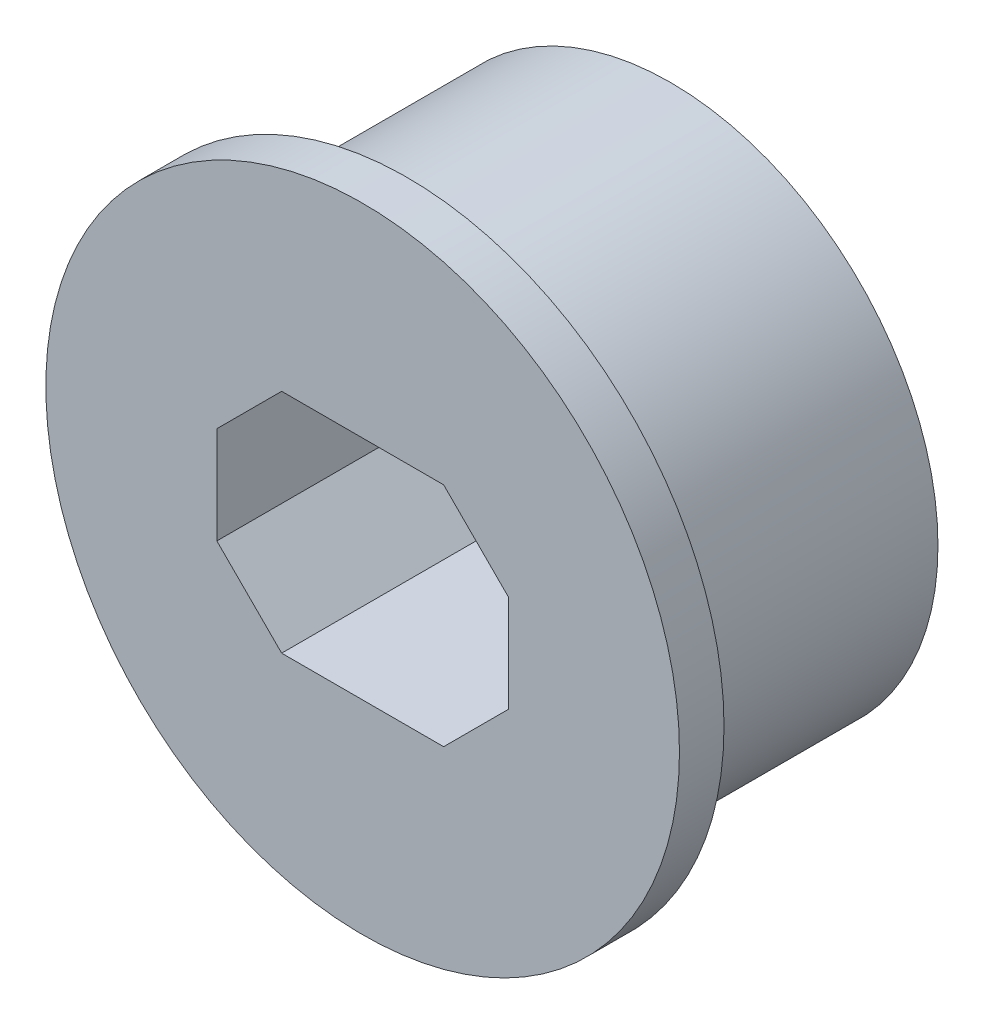
ISO-10303-21;
HEADER;
FILE_DESCRIPTION(('STEP AP214'),'2;1');
FILE_NAME('part.step','',(''),(''),'','','');
FILE_SCHEMA(('AUTOMOTIVE_DESIGN { 1 0 10303 214 1 1 1 1 }'));
ENDSEC;
DATA;
#1=APPLICATION_CONTEXT('core data for automotive mechanical design processes');
#2=APPLICATION_PROTOCOL_DEFINITION('international standard','automotive_design',2000,#1);
#3=PRODUCT_CONTEXT('',#1,'mechanical');
#4=PRODUCT('Part','Part','',(#3));
#5=PRODUCT_RELATED_PRODUCT_CATEGORY('part','',(#4));
#6=PRODUCT_DEFINITION_FORMATION('','',#4);
#7=PRODUCT_DEFINITION_CONTEXT('part definition',#1,'design');
#8=PRODUCT_DEFINITION('design','',#6,#7);
#9=PRODUCT_DEFINITION_SHAPE('','',#8);
#10=(LENGTH_UNIT() NAMED_UNIT(*) SI_UNIT(.MILLI.,.METRE.));
#11=(NAMED_UNIT(*) PLANE_ANGLE_UNIT() SI_UNIT($,.RADIAN.));
#12=(NAMED_UNIT(*) SI_UNIT($,.STERADIAN.) SOLID_ANGLE_UNIT());
#13=UNCERTAINTY_MEASURE_WITH_UNIT(LENGTH_MEASURE(1.E-05),#10,'distance_accuracy_value','');
#14=(GEOMETRIC_REPRESENTATION_CONTEXT(3) GLOBAL_UNCERTAINTY_ASSIGNED_CONTEXT((#13)) GLOBAL_UNIT_ASSIGNED_CONTEXT((#10,
#11,#12)) REPRESENTATION_CONTEXT('',''));
#15=CARTESIAN_POINT('',(0.,0.,0.));
#16=DIRECTION('',(0.,0.,1.));
#17=DIRECTION('',(1.,0.,0.));
#18=AXIS2_PLACEMENT_3D('',#15,#16,#17);
#19=CARTESIAN_POINT('',(6.731,-165.719229699861,1.5875));
#20=DIRECTION('',(0.,0.,-1.));
#21=DIRECTION('',(-1.,0.,0.));
#22=AXIS2_PLACEMENT_3D('',#19,#20,#21);
#23=CYLINDRICAL_SURFACE('',#22,4.8895);
#24=CARTESIAN_POINT('',(6.731,-165.719229699861,0.));
#25=DIRECTION('',(0.,0.,1.));
#26=DIRECTION('',(1.,0.,0.));
#27=AXIS2_PLACEMENT_3D('',#24,#25,#26);
#28=CIRCLE('',#27,4.8895);
#29=CARTESIAN_POINT('',(11.6205,-165.719229699861,0.));
#30=VERTEX_POINT('',#29);
#31=EDGE_CURVE('E150',#30,#30,#28,.T.);
#32=ORIENTED_EDGE('',*,*,#31,.T.);
#33=EDGE_LOOP('',(#32));
#34=FACE_BOUND('',#33,.T.);
#35=CARTESIAN_POINT('',(6.731,-165.719229699861,0.6875));
#36=DIRECTION('',(0.,0.,1.));
#37=DIRECTION('',(1.,0.,0.));
#38=AXIS2_PLACEMENT_3D('',#35,#36,#37);
#39=CIRCLE('',#38,4.8895);
#40=CARTESIAN_POINT('',(11.6205,-165.719229699861,0.6875));
#41=VERTEX_POINT('',#40);
#42=EDGE_CURVE('E112',#41,#41,#39,.T.);
#43=ORIENTED_EDGE('',*,*,#42,.F.);
#44=EDGE_LOOP('',(#43));
#45=FACE_BOUND('',#44,.T.);
#46=ADVANCED_FACE('F35',(#34,#45),#23,.T.);
#47=CARTESIAN_POINT('',(4.48100000000001,-163.969229699861,1.5875));
#48=DIRECTION('',(-1.,0.,0.));
#49=DIRECTION('',(0.,0.,1.));
#50=AXIS2_PLACEMENT_3D('',#47,#48,#49);
#51=PLANE('',#50);
#52=DIRECTION('',(0.,1.,0.));
#53=VECTOR('',#52,1.);
#54=CARTESIAN_POINT('',(4.48100000000001,-163.969229699861,0.6875));
#55=LINE('',#54,#53);
#56=CARTESIAN_POINT('',(4.48100000000001,-166.469229699861,0.6875));
#57=VERTEX_POINT('',#56);
#58=CARTESIAN_POINT('',(4.48100000000001,-164.969229699861,0.6875));
#59=VERTEX_POINT('',#58);
#60=EDGE_CURVE('E49',#57,#59,#55,.T.);
#61=ORIENTED_EDGE('',*,*,#60,.F.);
#62=DIRECTION('',(0.,0.,-1.));
#63=VECTOR('',#62,1.);
#64=CARTESIAN_POINT('',(4.48100000000001,-166.469229699861,-4.064));
#65=LINE('',#64,#63);
#66=CARTESIAN_POINT('',(4.48100000000001,-166.469229699861,-4.064));
#67=VERTEX_POINT('',#66);
#68=EDGE_CURVE('E128',#57,#67,#65,.T.);
#69=ORIENTED_EDGE('',*,*,#68,.T.);
#70=DIRECTION('',(0.,1.,0.));
#71=VECTOR('',#70,1.);
#72=CARTESIAN_POINT('',(4.48100000000001,-163.969229699861,-4.064));
#73=LINE('',#72,#71);
#74=CARTESIAN_POINT('',(4.48100000000001,-164.969229699861,-4.064));
#75=VERTEX_POINT('',#74);
#76=EDGE_CURVE('E141',#67,#75,#73,.T.);
#77=ORIENTED_EDGE('',*,*,#76,.T.);
#78=DIRECTION('',(0.,0.,1.));
#79=VECTOR('',#78,1.);
#80=CARTESIAN_POINT('',(4.48100000000001,-164.969229699861,1.5875));
#81=LINE('',#80,#79);
#82=EDGE_CURVE('E126',#75,#59,#81,.T.);
#83=ORIENTED_EDGE('',*,*,#82,.T.);
#84=EDGE_LOOP('',(#61,#69,#77,#83));
#85=FACE_BOUND('',#84,.T.);
#86=ADVANCED_FACE('F202',(#85),#51,.F.);
#87=CARTESIAN_POINT('',(8.98100000000001,-167.469229699861,1.5875));
#88=DIRECTION('',(0.,-1.,0.));
#89=DIRECTION('',(0.,0.,-1.));
#90=AXIS2_PLACEMENT_3D('',#87,#88,#89);
#91=PLANE('',#90);
#92=DIRECTION('',(-1.,0.,0.));
#93=VECTOR('',#92,1.);
#94=CARTESIAN_POINT('',(8.98100000000001,-167.469229699861,0.6875));
#95=LINE('',#94,#93);
#96=CARTESIAN_POINT('',(7.98100000000001,-167.469229699861,0.6875));
#97=VERTEX_POINT('',#96);
#98=CARTESIAN_POINT('',(5.481,-167.469229699861,0.6875));
#99=VERTEX_POINT('',#98);
#100=EDGE_CURVE('E163',#97,#99,#95,.T.);
#101=ORIENTED_EDGE('',*,*,#100,.F.);
#102=DIRECTION('',(0.,0.,-1.));
#103=VECTOR('',#102,1.);
#104=CARTESIAN_POINT('',(7.98100000000001,-167.469229699861,-4.064));
#105=LINE('',#104,#103);
#106=CARTESIAN_POINT('',(7.98100000000001,-167.469229699861,-4.064));
#107=VERTEX_POINT('',#106);
#108=EDGE_CURVE('E124',#97,#107,#105,.T.);
#109=ORIENTED_EDGE('',*,*,#108,.T.);
#110=DIRECTION('',(-1.,0.,0.));
#111=VECTOR('',#110,1.);
#112=CARTESIAN_POINT('',(8.98100000000001,-167.469229699861,-4.064));
#113=LINE('',#112,#111);
#114=CARTESIAN_POINT('',(5.481,-167.469229699861,-4.064));
#115=VERTEX_POINT('',#114);
#116=EDGE_CURVE('E140',#107,#115,#113,.T.);
#117=ORIENTED_EDGE('',*,*,#116,.T.);
#118=DIRECTION('',(0.,0.,1.));
#119=VECTOR('',#118,1.);
#120=CARTESIAN_POINT('',(5.481,-167.469229699861,1.5875));
#121=LINE('',#120,#119);
#122=EDGE_CURVE('E116',#115,#99,#121,.T.);
#123=ORIENTED_EDGE('',*,*,#122,.T.);
#124=EDGE_LOOP('',(#101,#109,#117,#123));
#125=FACE_BOUND('',#124,.T.);
#126=ADVANCED_FACE('F147',(#125),#91,.F.);
#127=CARTESIAN_POINT('',(8.98100000000001,-163.969229699861,1.5875));
#128=DIRECTION('',(1.,0.,0.));
#129=DIRECTION('',(0.,0.,-1.));
#130=AXIS2_PLACEMENT_3D('',#127,#128,#129);
#131=PLANE('',#130);
#132=DIRECTION('',(0.,-1.,0.));
#133=VECTOR('',#132,1.);
#134=CARTESIAN_POINT('',(8.98100000000001,-163.969229699861,0.6875));
#135=LINE('',#134,#133);
#136=CARTESIAN_POINT('',(8.98100000000001,-164.969229699861,0.6875));
#137=VERTEX_POINT('',#136);
#138=CARTESIAN_POINT('',(8.98100000000001,-166.469229699861,0.6875));
#139=VERTEX_POINT('',#138);
#140=EDGE_CURVE('E158',#137,#139,#135,.T.);
#141=ORIENTED_EDGE('',*,*,#140,.F.);
#142=DIRECTION('',(0.,0.,-1.));
#143=VECTOR('',#142,1.);
#144=CARTESIAN_POINT('',(8.98100000000001,-164.969229699861,-4.064));
#145=LINE('',#144,#143);
#146=CARTESIAN_POINT('',(8.98100000000001,-164.969229699861,-4.064));
#147=VERTEX_POINT('',#146);
#148=EDGE_CURVE('E114',#137,#147,#145,.T.);
#149=ORIENTED_EDGE('',*,*,#148,.T.);
#150=DIRECTION('',(0.,-1.,0.));
#151=VECTOR('',#150,1.);
#152=CARTESIAN_POINT('',(8.98100000000001,-163.969229699861,-4.064));
#153=LINE('',#152,#151);
#154=CARTESIAN_POINT('',(8.98100000000001,-166.469229699861,-4.064));
#155=VERTEX_POINT('',#154);
#156=EDGE_CURVE('E151',#147,#155,#153,.T.);
#157=ORIENTED_EDGE('',*,*,#156,.T.);
#158=DIRECTION('',(0.,0.,1.));
#159=VECTOR('',#158,1.);
#160=CARTESIAN_POINT('',(8.98100000000001,-166.469229699861,1.5875));
#161=LINE('',#160,#159);
#162=EDGE_CURVE('E118',#155,#139,#161,.T.);
#163=ORIENTED_EDGE('',*,*,#162,.T.);
#164=EDGE_LOOP('',(#141,#149,#157,#163));
#165=FACE_BOUND('',#164,.T.);
#166=ADVANCED_FACE('F183',(#165),#131,.F.);
#167=CARTESIAN_POINT('',(8.98100000000001,-163.969229699861,1.5875));
#168=DIRECTION('',(0.,1.,0.));
#169=DIRECTION('',(0.,0.,1.));
#170=AXIS2_PLACEMENT_3D('',#167,#168,#169);
#171=PLANE('',#170);
#172=DIRECTION('',(1.,0.,0.));
#173=VECTOR('',#172,1.);
#174=CARTESIAN_POINT('',(8.98100000000001,-163.969229699861,0.6875));
#175=LINE('',#174,#173);
#176=CARTESIAN_POINT('',(5.48100000000002,-163.969229699861,0.6875));
#177=VERTEX_POINT('',#176);
#178=CARTESIAN_POINT('',(7.98100000000002,-163.969229699861,0.6875));
#179=VERTEX_POINT('',#178);
#180=EDGE_CURVE('E99',#177,#179,#175,.T.);
#181=ORIENTED_EDGE('',*,*,#180,.F.);
#182=DIRECTION('',(0.,0.,-1.));
#183=VECTOR('',#182,1.);
#184=CARTESIAN_POINT('',(5.48100000000002,-163.969229699861,-4.064));
#185=LINE('',#184,#183);
#186=CARTESIAN_POINT('',(5.48100000000002,-163.969229699861,-4.064));
#187=VERTEX_POINT('',#186);
#188=EDGE_CURVE('E109',#177,#187,#185,.T.);
#189=ORIENTED_EDGE('',*,*,#188,.T.);
#190=DIRECTION('',(1.,0.,0.));
#191=VECTOR('',#190,1.);
#192=CARTESIAN_POINT('',(8.98100000000001,-163.969229699861,-4.064));
#193=LINE('',#192,#191);
#194=CARTESIAN_POINT('',(7.98100000000002,-163.969229699861,-4.064));
#195=VERTEX_POINT('',#194);
#196=EDGE_CURVE('E168',#187,#195,#193,.T.);
#197=ORIENTED_EDGE('',*,*,#196,.T.);
#198=DIRECTION('',(0.,0.,1.));
#199=VECTOR('',#198,1.);
#200=CARTESIAN_POINT('',(7.98100000000002,-163.969229699861,1.5875));
#201=LINE('',#200,#199);
#202=EDGE_CURVE('E111',#195,#179,#201,.T.);
#203=ORIENTED_EDGE('',*,*,#202,.T.);
#204=EDGE_LOOP('',(#181,#189,#197,#203));
#205=FACE_BOUND('',#204,.T.);
#206=ADVANCED_FACE('F107',(#205),#171,.F.);
#207=CARTESIAN_POINT('',(8.98100000000001,-164.969229699861,1.5875));
#208=DIRECTION('',(-0.707106781186551,-0.707106781186544,0.));
#209=DIRECTION('',(0.,0.,1.));
#210=AXIS2_PLACEMENT_3D('',#207,#208,#209);
#211=PLANE('',#210);
#212=DIRECTION('',(-0.707106781186544,0.707106781186551,0.));
#213=VECTOR('',#212,1.);
#214=CARTESIAN_POINT('',(8.98100000000001,-164.969229699861,0.6875));
#215=LINE('',#214,#213);
#216=EDGE_CURVE('E156',#179,#137,#215,.F.);
#217=ORIENTED_EDGE('',*,*,#216,.F.);
#218=ORIENTED_EDGE('',*,*,#202,.F.);
#219=DIRECTION('',(0.707106781186544,-0.707106781186551,0.));
#220=VECTOR('',#219,1.);
#221=CARTESIAN_POINT('',(8.23100000000002,-164.219229699861,-4.064));
#222=LINE('',#221,#220);
#223=EDGE_CURVE('E130',#147,#195,#222,.F.);
#224=ORIENTED_EDGE('',*,*,#223,.F.);
#225=ORIENTED_EDGE('',*,*,#148,.F.);
#226=EDGE_LOOP('',(#217,#218,#224,#225));
#227=FACE_BOUND('',#226,.T.);
#228=ADVANCED_FACE('F190',(#227),#211,.T.);
#229=CARTESIAN_POINT('',(7.98100000000001,-167.469229699861,1.5875));
#230=DIRECTION('',(-0.707106781186546,0.707106781186549,0.));
#231=DIRECTION('',(0.,0.,1.));
#232=AXIS2_PLACEMENT_3D('',#229,#230,#231);
#233=PLANE('',#232);
#234=DIRECTION('',(0.707106781186549,0.707106781186546,0.));
#235=VECTOR('',#234,1.);
#236=CARTESIAN_POINT('',(7.98100000000001,-167.469229699861,0.6875));
#237=LINE('',#236,#235);
#238=EDGE_CURVE('E165',#139,#97,#237,.F.);
#239=ORIENTED_EDGE('',*,*,#238,.F.);
#240=ORIENTED_EDGE('',*,*,#162,.F.);
#241=DIRECTION('',(-0.707106781186549,-0.707106781186546,0.));
#242=VECTOR('',#241,1.);
#243=CARTESIAN_POINT('',(8.231,-167.219229699861,-4.064));
#244=LINE('',#243,#242);
#245=EDGE_CURVE('E132',#107,#155,#244,.F.);
#246=ORIENTED_EDGE('',*,*,#245,.F.);
#247=ORIENTED_EDGE('',*,*,#108,.F.);
#248=EDGE_LOOP('',(#239,#240,#246,#247));
#249=FACE_BOUND('',#248,.T.);
#250=ADVANCED_FACE('F188',(#249),#233,.T.);
#251=CARTESIAN_POINT('',(4.48100000000001,-166.469229699861,1.5875));
#252=DIRECTION('',(0.707106781186553,0.707106781186542,0.));
#253=DIRECTION('',(0.,0.,1.));
#254=AXIS2_PLACEMENT_3D('',#251,#252,#253);
#255=PLANE('',#254);
#256=DIRECTION('',(0.707106781186542,-0.707106781186553,0.));
#257=VECTOR('',#256,1.);
#258=CARTESIAN_POINT('',(4.48100000000001,-166.469229699861,0.6875));
#259=LINE('',#258,#257);
#260=EDGE_CURVE('E155',#99,#57,#259,.F.);
#261=ORIENTED_EDGE('',*,*,#260,.F.);
#262=ORIENTED_EDGE('',*,*,#122,.F.);
#263=DIRECTION('',(-0.707106781186542,0.707106781186553,0.));
#264=VECTOR('',#263,1.);
#265=CARTESIAN_POINT('',(5.23099999999999,-167.219229699861,-4.064));
#266=LINE('',#265,#264);
#267=EDGE_CURVE('E134',#67,#115,#266,.F.);
#268=ORIENTED_EDGE('',*,*,#267,.F.);
#269=ORIENTED_EDGE('',*,*,#68,.F.);
#270=EDGE_LOOP('',(#261,#262,#268,#269));
#271=FACE_BOUND('',#270,.T.);
#272=ADVANCED_FACE('F154',(#271),#255,.T.);
#273=CARTESIAN_POINT('',(5.48100000000002,-163.969229699861,1.5875));
#274=DIRECTION('',(0.707106781186545,-0.70710678118655,0.));
#275=DIRECTION('',(0.,0.,1.));
#276=AXIS2_PLACEMENT_3D('',#273,#274,#275);
#277=PLANE('',#276);
#278=DIRECTION('',(-0.70710678118655,-0.707106781186545,0.));
#279=VECTOR('',#278,1.);
#280=CARTESIAN_POINT('',(5.48100000000002,-163.969229699861,0.6875));
#281=LINE('',#280,#279);
#282=EDGE_CURVE('E11',#59,#177,#281,.F.);
#283=ORIENTED_EDGE('',*,*,#282,.F.);
#284=ORIENTED_EDGE('',*,*,#82,.F.);
#285=DIRECTION('',(0.70710678118655,0.707106781186545,0.));
#286=VECTOR('',#285,1.);
#287=CARTESIAN_POINT('',(5.23100000000001,-164.219229699861,-4.064));
#288=LINE('',#287,#286);
#289=EDGE_CURVE('E43',#187,#75,#288,.F.);
#290=ORIENTED_EDGE('',*,*,#289,.F.);
#291=ORIENTED_EDGE('',*,*,#188,.F.);
#292=EDGE_LOOP('',(#283,#284,#290,#291));
#293=FACE_BOUND('',#292,.T.);
#294=ADVANCED_FACE('F37',(#293),#277,.T.);
#295=CARTESIAN_POINT('',(6.731,-165.719229699861,-4.064));
#296=DIRECTION('',(0.,0.,1.));
#297=DIRECTION('',(1.,0.,0.));
#298=AXIS2_PLACEMENT_3D('',#295,#296,#297);
#299=CYLINDRICAL_SURFACE('',#298,4.1275);
#300=CARTESIAN_POINT('',(6.731,-165.719229699861,-4.064));
#301=DIRECTION('',(0.,0.,1.));
#302=DIRECTION('',(1.,0.,0.));
#303=AXIS2_PLACEMENT_3D('',#300,#301,#302);
#304=CIRCLE('',#303,4.1275);
#305=CARTESIAN_POINT('',(10.8585,-165.719229699861,-4.064));
#306=VERTEX_POINT('',#305);
#307=EDGE_CURVE('E175',#306,#306,#304,.T.);
#308=ORIENTED_EDGE('',*,*,#307,.T.);
#309=EDGE_LOOP('',(#308));
#310=FACE_BOUND('',#309,.T.);
#311=CARTESIAN_POINT('',(6.731,-165.719229699861,0.));
#312=DIRECTION('',(0.,0.,1.));
#313=DIRECTION('',(1.,0.,0.));
#314=AXIS2_PLACEMENT_3D('',#311,#312,#313);
#315=CIRCLE('',#314,4.1275);
#316=CARTESIAN_POINT('',(10.8585,-165.719229699861,0.));
#317=VERTEX_POINT('',#316);
#318=EDGE_CURVE('E174',#317,#317,#315,.T.);
#319=ORIENTED_EDGE('',*,*,#318,.F.);
#320=EDGE_LOOP('',(#319));
#321=FACE_BOUND('',#320,.T.);
#322=ADVANCED_FACE('F215',(#310,#321),#299,.T.);
#323=CARTESIAN_POINT('',(6.731,-165.719229699861,-4.064));
#324=DIRECTION('',(0.,0.,1.));
#325=DIRECTION('',(1.,0.,0.));
#326=AXIS2_PLACEMENT_3D('',#323,#324,#325);
#327=PLANE('',#326);
#328=ORIENTED_EDGE('',*,*,#196,.F.);
#329=ORIENTED_EDGE('',*,*,#289,.T.);
#330=ORIENTED_EDGE('',*,*,#76,.F.);
#331=ORIENTED_EDGE('',*,*,#267,.T.);
#332=ORIENTED_EDGE('',*,*,#116,.F.);
#333=ORIENTED_EDGE('',*,*,#245,.T.);
#334=ORIENTED_EDGE('',*,*,#156,.F.);
#335=ORIENTED_EDGE('',*,*,#223,.T.);
#336=EDGE_LOOP('',(#328,#329,#330,#331,#332,#333,#334,#335));
#337=FACE_BOUND('',#336,.T.);
#338=ORIENTED_EDGE('',*,*,#307,.F.);
#339=EDGE_LOOP('',(#338));
#340=FACE_BOUND('',#339,.T.);
#341=ADVANCED_FACE('F138',(#337,#340),#327,.F.);
#342=CARTESIAN_POINT('',(6.731,-165.719229699861,0.));
#343=DIRECTION('',(0.,0.,1.));
#344=DIRECTION('',(1.,0.,0.));
#345=AXIS2_PLACEMENT_3D('',#342,#343,#344);
#346=PLANE('',#345);
#347=ORIENTED_EDGE('',*,*,#318,.T.);
#348=EDGE_LOOP('',(#347));
#349=FACE_BOUND('',#348,.T.);
#350=ORIENTED_EDGE('',*,*,#31,.F.);
#351=EDGE_LOOP('',(#350));
#352=FACE_BOUND('',#351,.T.);
#353=ADVANCED_FACE('F213',(#349,#352),#346,.F.);
#354=CARTESIAN_POINT('',(6.731,-165.719229699861,0.6875));
#355=DIRECTION('',(0.,0.,1.));
#356=DIRECTION('',(1.,0.,0.));
#357=AXIS2_PLACEMENT_3D('',#354,#355,#356);
#358=PLANE('',#357);
#359=ORIENTED_EDGE('',*,*,#42,.T.);
#360=EDGE_LOOP('',(#359));
#361=FACE_BOUND('',#360,.T.);
#362=ORIENTED_EDGE('',*,*,#238,.T.);
#363=ORIENTED_EDGE('',*,*,#100,.T.);
#364=ORIENTED_EDGE('',*,*,#260,.T.);
#365=ORIENTED_EDGE('',*,*,#60,.T.);
#366=ORIENTED_EDGE('',*,*,#282,.T.);
#367=ORIENTED_EDGE('',*,*,#180,.T.);
#368=ORIENTED_EDGE('',*,*,#216,.T.);
#369=ORIENTED_EDGE('',*,*,#140,.T.);
#370=EDGE_LOOP('',(#362,#363,#364,#365,#366,#367,#368,#369));
#371=FACE_BOUND('',#370,.T.);
#372=ADVANCED_FACE('F98',(#361,#371),#358,.T.);
#373=CLOSED_SHELL('',(#46,#86,#126,#166,#206,#228,#250,#272,#294,#322,#341,#353,#372));
#374=MANIFOLD_SOLID_BREP('B2',#373);
#375=ADVANCED_BREP_SHAPE_REPRESENTATION('',(#18,#374),#14);
#376=SHAPE_DEFINITION_REPRESENTATION(#9,#375);
ENDSEC;
END-ISO-10303-21;
